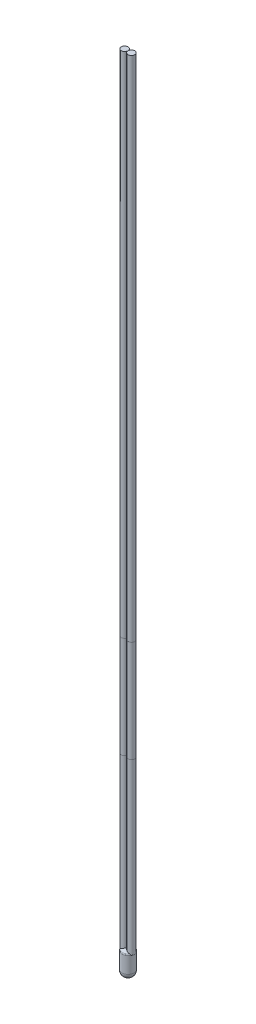
ISO-10303-21;
HEADER;
FILE_DESCRIPTION(('STEP AP214'),'2;1');
FILE_NAME('part.step','',(''),(''),'','','');
FILE_SCHEMA(('AUTOMOTIVE_DESIGN { 1 0 10303 214 1 1 1 1 }'));
ENDSEC;
DATA;
#1=APPLICATION_CONTEXT('core data for automotive mechanical design processes');
#2=APPLICATION_PROTOCOL_DEFINITION('international standard','automotive_design',2000,#1);
#3=PRODUCT_CONTEXT('',#1,'mechanical');
#4=PRODUCT('Part','Part','',(#3));
#5=PRODUCT_RELATED_PRODUCT_CATEGORY('part','',(#4));
#6=PRODUCT_DEFINITION_FORMATION('','',#4);
#7=PRODUCT_DEFINITION_CONTEXT('part definition',#1,'design');
#8=PRODUCT_DEFINITION('design','',#6,#7);
#9=PRODUCT_DEFINITION_SHAPE('','',#8);
#10=(LENGTH_UNIT() NAMED_UNIT(*) SI_UNIT(.MILLI.,.METRE.));
#11=(NAMED_UNIT(*) PLANE_ANGLE_UNIT() SI_UNIT($,.RADIAN.));
#12=(NAMED_UNIT(*) SI_UNIT($,.STERADIAN.) SOLID_ANGLE_UNIT());
#13=UNCERTAINTY_MEASURE_WITH_UNIT(LENGTH_MEASURE(1.E-05),#10,'distance_accuracy_value','');
#14=(GEOMETRIC_REPRESENTATION_CONTEXT(3) GLOBAL_UNCERTAINTY_ASSIGNED_CONTEXT((#13)) GLOBAL_UNIT_ASSIGNED_CONTEXT((#10,
#11,#12)) REPRESENTATION_CONTEXT('',''));
#15=CARTESIAN_POINT('',(0.,0.,0.));
#16=DIRECTION('',(0.,0.,1.));
#17=DIRECTION('',(1.,0.,0.));
#18=AXIS2_PLACEMENT_3D('',#15,#16,#17);
#19=CARTESIAN_POINT('',(0.4,117.41515621348,0.));
#20=DIRECTION('',(0.,-1.,0.));
#21=DIRECTION('',(0.,0.,-1.));
#22=AXIS2_PLACEMENT_3D('',#19,#20,#21);
#23=CYLINDRICAL_SURFACE('',#22,0.5);
#24=CARTESIAN_POINT('',(0.4,117.41515621348,0.));
#25=DIRECTION('',(0.,-1.,0.));
#26=DIRECTION('',(0.,0.,-1.));
#27=AXIS2_PLACEMENT_3D('',#24,#25,#26);
#28=CIRCLE('',#27,0.5);
#29=CARTESIAN_POINT('',(0.4,117.41515621348,-0.5));
#30=VERTEX_POINT('',#29);
#31=EDGE_CURVE('E11',#30,#30,#28,.T.);
#32=ORIENTED_EDGE('',*,*,#31,.T.);
#33=EDGE_LOOP('',(#32));
#34=FACE_BOUND('',#33,.T.);
#35=CARTESIAN_POINT('',(0.4,42.4151562134801,0.));
#36=DIRECTION('',(0.,-1.,0.));
#37=DIRECTION('',(0.,0.,-1.));
#38=AXIS2_PLACEMENT_3D('',#35,#36,#37);
#39=CIRCLE('',#38,0.5);
#40=CARTESIAN_POINT('',(0.4,42.4151562134801,-0.5));
#41=VERTEX_POINT('',#40);
#42=EDGE_CURVE('E46',#41,#41,#39,.T.);
#43=ORIENTED_EDGE('',*,*,#42,.F.);
#44=EDGE_LOOP('',(#43));
#45=FACE_BOUND('',#44,.T.);
#46=ADVANCED_FACE('F43',(#34,#45),#23,.T.);
#47=CARTESIAN_POINT('',(0.4,117.41515621348,0.));
#48=DIRECTION('',(0.,-1.,0.));
#49=DIRECTION('',(0.,0.,-1.));
#50=AXIS2_PLACEMENT_3D('',#47,#48,#49);
#51=PLANE('',#50);
#52=ORIENTED_EDGE('',*,*,#31,.F.);
#53=EDGE_LOOP('',(#52));
#54=FACE_BOUND('',#53,.T.);
#55=ADVANCED_FACE('F58',(#54),#51,.F.);
#56=CARTESIAN_POINT('',(0.4,42.4151562134801,0.));
#57=DIRECTION('',(0.,-1.,0.));
#58=DIRECTION('',(0.,0.,-1.));
#59=AXIS2_PLACEMENT_3D('',#56,#57,#58);
#60=PLANE('',#59);
#61=ORIENTED_EDGE('',*,*,#42,.T.);
#62=EDGE_LOOP('',(#61));
#63=FACE_BOUND('',#62,.T.);
#64=ADVANCED_FACE('F55',(#63),#60,.T.);
#65=CLOSED_SHELL('',(#46,#55,#64));
#66=MANIFOLD_SOLID_BREP('B2',#65);
#67=CARTESIAN_POINT('',(1.41,117.41515621348,0.));
#68=DIRECTION('',(0.,-1.,0.));
#69=DIRECTION('',(0.,0.,-1.));
#70=AXIS2_PLACEMENT_3D('',#67,#68,#69);
#71=CYLINDRICAL_SURFACE('',#70,0.5);
#72=CARTESIAN_POINT('',(1.41,117.41515621348,0.));
#73=DIRECTION('',(0.,-1.,0.));
#74=DIRECTION('',(0.,0.,-1.));
#75=AXIS2_PLACEMENT_3D('',#72,#73,#74);
#76=CIRCLE('',#75,0.5);
#77=CARTESIAN_POINT('',(1.41,117.41515621348,-0.5));
#78=VERTEX_POINT('',#77);
#79=EDGE_CURVE('E42',#78,#78,#76,.T.);
#80=ORIENTED_EDGE('',*,*,#79,.T.);
#81=EDGE_LOOP('',(#80));
#82=FACE_BOUND('',#81,.T.);
#83=CARTESIAN_POINT('',(1.41,42.4151562134801,0.));
#84=DIRECTION('',(0.,-1.,0.));
#85=DIRECTION('',(0.,0.,-1.));
#86=AXIS2_PLACEMENT_3D('',#83,#84,#85);
#87=CIRCLE('',#86,0.5);
#88=CARTESIAN_POINT('',(1.41,42.4151562134801,-0.5));
#89=VERTEX_POINT('',#88);
#90=EDGE_CURVE('E96',#89,#89,#87,.T.);
#91=ORIENTED_EDGE('',*,*,#90,.F.);
#92=EDGE_LOOP('',(#91));
#93=FACE_BOUND('',#92,.T.);
#94=ADVANCED_FACE('F93',(#82,#93),#71,.T.);
#95=CARTESIAN_POINT('',(1.41,117.41515621348,0.));
#96=DIRECTION('',(0.,-1.,0.));
#97=DIRECTION('',(0.,0.,-1.));
#98=AXIS2_PLACEMENT_3D('',#95,#96,#97);
#99=PLANE('',#98);
#100=ORIENTED_EDGE('',*,*,#79,.F.);
#101=EDGE_LOOP('',(#100));
#102=FACE_BOUND('',#101,.T.);
#103=ADVANCED_FACE('F108',(#102),#99,.F.);
#104=CARTESIAN_POINT('',(1.41,42.4151562134801,0.));
#105=DIRECTION('',(0.,-1.,0.));
#106=DIRECTION('',(0.,0.,-1.));
#107=AXIS2_PLACEMENT_3D('',#104,#105,#106);
#108=PLANE('',#107);
#109=ORIENTED_EDGE('',*,*,#90,.T.);
#110=EDGE_LOOP('',(#109));
#111=FACE_BOUND('',#110,.T.);
#112=ADVANCED_FACE('F105',(#111),#108,.T.);
#113=CLOSED_SHELL('',(#94,#103,#112));
#114=MANIFOLD_SOLID_BREP('B6',#113);
#115=CARTESIAN_POINT('',(0.4,42.41515621348,0.));
#116=DIRECTION('',(0.,-1.,0.));
#117=DIRECTION('',(0.,0.,-1.));
#118=AXIS2_PLACEMENT_3D('',#115,#116,#117);
#119=CYLINDRICAL_SURFACE('',#118,0.5);
#120=CARTESIAN_POINT('',(0.4,42.41515621348,0.));
#121=DIRECTION('',(0.,-1.,0.));
#122=DIRECTION('',(0.,0.,-1.));
#123=AXIS2_PLACEMENT_3D('',#120,#121,#122);
#124=CIRCLE('',#123,0.5);
#125=CARTESIAN_POINT('',(0.4,42.41515621348,-0.5));
#126=VERTEX_POINT('',#125);
#127=EDGE_CURVE('E92',#126,#126,#124,.T.);
#128=ORIENTED_EDGE('',*,*,#127,.T.);
#129=EDGE_LOOP('',(#128));
#130=FACE_BOUND('',#129,.T.);
#131=CARTESIAN_POINT('',(0.4,27.4151562134801,0.));
#132=DIRECTION('',(0.,-1.,0.));
#133=DIRECTION('',(0.,0.,-1.));
#134=AXIS2_PLACEMENT_3D('',#131,#132,#133);
#135=CIRCLE('',#134,0.5);
#136=CARTESIAN_POINT('',(0.4,27.4151562134801,-0.5));
#137=VERTEX_POINT('',#136);
#138=EDGE_CURVE('E146',#137,#137,#135,.T.);
#139=ORIENTED_EDGE('',*,*,#138,.F.);
#140=EDGE_LOOP('',(#139));
#141=FACE_BOUND('',#140,.T.);
#142=ADVANCED_FACE('F143',(#130,#141),#119,.T.);
#143=CARTESIAN_POINT('',(0.4,42.41515621348,0.));
#144=DIRECTION('',(0.,-1.,0.));
#145=DIRECTION('',(0.,0.,-1.));
#146=AXIS2_PLACEMENT_3D('',#143,#144,#145);
#147=PLANE('',#146);
#148=ORIENTED_EDGE('',*,*,#127,.F.);
#149=EDGE_LOOP('',(#148));
#150=FACE_BOUND('',#149,.T.);
#151=ADVANCED_FACE('F158',(#150),#147,.F.);
#152=CARTESIAN_POINT('',(0.4,27.4151562134801,0.));
#153=DIRECTION('',(0.,-1.,0.));
#154=DIRECTION('',(0.,0.,-1.));
#155=AXIS2_PLACEMENT_3D('',#152,#153,#154);
#156=PLANE('',#155);
#157=ORIENTED_EDGE('',*,*,#138,.T.);
#158=EDGE_LOOP('',(#157));
#159=FACE_BOUND('',#158,.T.);
#160=ADVANCED_FACE('F155',(#159),#156,.T.);
#161=CLOSED_SHELL('',(#142,#151,#160));
#162=MANIFOLD_SOLID_BREP('B37',#161);
#163=CARTESIAN_POINT('',(1.41,42.41515621348,0.));
#164=DIRECTION('',(0.,-1.,0.));
#165=DIRECTION('',(0.,0.,-1.));
#166=AXIS2_PLACEMENT_3D('',#163,#164,#165);
#167=CYLINDRICAL_SURFACE('',#166,0.5);
#168=CARTESIAN_POINT('',(1.41,42.41515621348,0.));
#169=DIRECTION('',(0.,-1.,0.));
#170=DIRECTION('',(0.,0.,-1.));
#171=AXIS2_PLACEMENT_3D('',#168,#169,#170);
#172=CIRCLE('',#171,0.5);
#173=CARTESIAN_POINT('',(1.41,42.41515621348,-0.5));
#174=VERTEX_POINT('',#173);
#175=EDGE_CURVE('E142',#174,#174,#172,.T.);
#176=ORIENTED_EDGE('',*,*,#175,.T.);
#177=EDGE_LOOP('',(#176));
#178=FACE_BOUND('',#177,.T.);
#179=CARTESIAN_POINT('',(1.41,27.4151562134801,0.));
#180=DIRECTION('',(0.,-1.,0.));
#181=DIRECTION('',(0.,0.,-1.));
#182=AXIS2_PLACEMENT_3D('',#179,#180,#181);
#183=CIRCLE('',#182,0.5);
#184=CARTESIAN_POINT('',(1.41,27.4151562134801,-0.5));
#185=VERTEX_POINT('',#184);
#186=EDGE_CURVE('E197',#185,#185,#183,.T.);
#187=ORIENTED_EDGE('',*,*,#186,.F.);
#188=EDGE_LOOP('',(#187));
#189=FACE_BOUND('',#188,.T.);
#190=ADVANCED_FACE('F194',(#178,#189),#167,.T.);
#191=CARTESIAN_POINT('',(1.41,42.41515621348,0.));
#192=DIRECTION('',(0.,-1.,0.));
#193=DIRECTION('',(0.,0.,-1.));
#194=AXIS2_PLACEMENT_3D('',#191,#192,#193);
#195=PLANE('',#194);
#196=ORIENTED_EDGE('',*,*,#175,.F.);
#197=EDGE_LOOP('',(#196));
#198=FACE_BOUND('',#197,.T.);
#199=ADVANCED_FACE('F209',(#198),#195,.F.);
#200=CARTESIAN_POINT('',(1.41,27.4151562134801,0.));
#201=DIRECTION('',(0.,-1.,0.));
#202=DIRECTION('',(0.,0.,-1.));
#203=AXIS2_PLACEMENT_3D('',#200,#201,#202);
#204=PLANE('',#203);
#205=ORIENTED_EDGE('',*,*,#186,.T.);
#206=EDGE_LOOP('',(#205));
#207=FACE_BOUND('',#206,.T.);
#208=ADVANCED_FACE('F206',(#207),#204,.T.);
#209=CLOSED_SHELL('',(#190,#199,#208));
#210=MANIFOLD_SOLID_BREP('B87',#209);
#211=CARTESIAN_POINT('',(0.9,2.41515621348005,0.));
#212=DIRECTION('',(0.,-1.,0.));
#213=DIRECTION('',(0.,0.,-1.));
#214=AXIS2_PLACEMENT_3D('',#211,#212,#213);
#215=TOROIDAL_SURFACE('',#214,0.7,0.2);
#216=CARTESIAN_POINT('',(0.342710554276178,2.6096711374537,-0.496707076060587));
#217=CARTESIAN_POINT('',(0.326116842533661,2.60699686254503,-0.494806533452094));
#218=CARTESIAN_POINT('',(0.309770034542115,2.6034465481936,-0.492066096214566));
#219=CARTESIAN_POINT('',(0.277889544530881,2.59470746117517,-0.48512967125796));
#220=CARTESIAN_POINT('',(0.262353719484357,2.58952329123451,-0.480937769219657));
#221=CARTESIAN_POINT('',(0.240017999274765,2.58066687672155,-0.473777730533588));
#222=CARTESIAN_POINT('',(0.232822842991616,2.57758212381183,-0.471284008196725));
#223=CARTESIAN_POINT('',(0.219024349225774,2.57118780814072,-0.466153855243099));
#224=CARTESIAN_POINT('',(0.212408981894553,2.56789487751942,-0.463529092972427));
#225=CARTESIAN_POINT('',(0.191949179806998,2.55694717914873,-0.454911632549412));
#226=CARTESIAN_POINT('',(0.178598488792885,2.54865469906437,-0.448536577987828));
#227=CARTESIAN_POINT('',(0.153524784459558,2.53020932378214,-0.435257162414345));
#228=CARTESIAN_POINT('',(0.141799299389649,2.52005930947381,-0.428353630542701));
#229=CARTESIAN_POINT('',(0.126569418460339,2.50363697795189,-0.418649525357035));
#230=CARTESIAN_POINT('',(0.122113207881949,2.49833768250554,-0.415697637179596));
#231=CARTESIAN_POINT('',(0.113792469919316,2.48716320505702,-0.410012721510245));
#232=CARTESIAN_POINT('',(0.109928621893607,2.48128737432261,-0.407279946999101));
#233=CARTESIAN_POINT('',(0.102936878314275,2.46879544056318,-0.402209449874787));
#234=CARTESIAN_POINT('',(0.0998222709618778,2.46216866395595,-0.399879041914674));
#235=CARTESIAN_POINT('',(0.094741260965691,2.44827830657245,-0.396014595776549));
#236=CARTESIAN_POINT('',(0.0927685097705873,2.44101851011371,-0.394476159746476));
#237=CARTESIAN_POINT('',(0.0910191836531889,2.43051207891519,-0.393104583886525));
#238=CARTESIAN_POINT('',(0.0906334576828592,2.42742055037154,-0.392800747026939));
#239=CARTESIAN_POINT('',(0.0901213443102036,2.42120391854913,-0.392396925349576));
#240=CARTESIAN_POINT('',(0.0899946835782171,2.41807885415697,-0.392296725682827));
#241=CARTESIAN_POINT('',(0.0900011063698889,2.41442991486687,-0.392301775511847));
#242=CARTESIAN_POINT('',(0.0900057868956716,2.4139036851019,-0.392305472963729));
#243=CARTESIAN_POINT('',(0.090014235433944,2.413377623837,-0.392312153477811));
#244=B_SPLINE_CURVE_WITH_KNOTS('',3,(#216,#217,#218,#219,#220,#221,#222,#223,#224,#225,#226,
#227,#228,#229,#230,#231,#232,#233,#234,#235,#236,#237,#238,#239,#240,#241,#242,#243),
.UNSPECIFIED.,.F.,.F.,(4,2,2,2,2,2,2,2,2,2,2,2,2,4),(0.,0.0506923185590828,0.101243089641447,
0.125877301665452,0.149389824798402,0.20011250552543,0.25075717596154,0.27330306641228,
0.295874623529552,0.3188210426462,0.341638626278481,0.351015232615933,0.360381940946825,
0.361960632231357),.UNSPECIFIED.);
#245=CARTESIAN_POINT('',(0.20555555555555,2.56422741198005,-0.460642331993803));
#246=VERTEX_POINT('',#245);
#247=CARTESIAN_POINT('',(0.0899999999999998,2.41515621348005,-0.39230090491866));
#248=VERTEX_POINT('',#247);
#249=EDGE_CURVE('E192',#246,#248,#244,.T.);
#250=ORIENTED_EDGE('',*,*,#249,.F.);
#251=CARTESIAN_POINT('',(0.9,2.56422741198004,0.));
#252=DIRECTION('',(0.,-1.,0.));
#253=DIRECTION('',(0.,0.,-1.));
#254=AXIS2_PLACEMENT_3D('',#251,#252,#253);
#255=CIRCLE('',#254,0.833333333333334);
#256=CARTESIAN_POINT('',(1.59072984749455,2.56422741198004,-0.466193867639426));
#257=VERTEX_POINT('',#256);
#258=EDGE_CURVE('E309',#257,#246,#255,.F.);
#259=ORIENTED_EDGE('',*,*,#258,.F.);
#260=CARTESIAN_POINT('',(1.70365777107542,2.40610173241104,-0.404679025262014));
#261=CARTESIAN_POINT('',(1.70389604383328,2.40904204718788,-0.404505427623607));
#262=CARTESIAN_POINT('',(1.70401566567529,2.41199833082941,-0.404418765222738));
#263=CARTESIAN_POINT('',(1.70402668102433,2.42065067536452,-0.404411663469807));
#264=CARTESIAN_POINT('',(1.70360453014876,2.42635106369644,-0.404719190328309));
#265=CARTESIAN_POINT('',(1.70193926885174,2.43757238417548,-0.40592158000119));
#266=CARTESIAN_POINT('',(1.70069414529646,2.44309284134493,-0.406817883031015));
#267=CARTESIAN_POINT('',(1.69705529388377,2.45534086403292,-0.409396462160241));
#268=CARTESIAN_POINT('',(1.69443632157332,2.46196830108167,-0.411229328202113));
#269=CARTESIAN_POINT('',(1.6883251125363,2.47463803783951,-0.415390033418));
#270=CARTESIAN_POINT('',(1.68483062700322,2.48067877425613,-0.41771914488632));
#271=CARTESIAN_POINT('',(1.67457897002656,2.49613661768594,-0.424329704327437));
#272=CARTESIAN_POINT('',(1.667222470359,2.50504524868047,-0.428858950109334));
#273=CARTESIAN_POINT('',(1.65127117178204,2.52156502452982,-0.438034406679147));
#274=CARTESIAN_POINT('',(1.64267468715311,2.52917437179056,-0.44268076947054));
#275=CARTESIAN_POINT('',(1.6201387405292,2.54676032002925,-0.453945963240291));
#276=CARTESIAN_POINT('',(1.60562904284585,2.55609680442867,-0.46042934676598));
#277=CARTESIAN_POINT('',(1.57632755446303,2.57208750828596,-0.471766359791853));
#278=CARTESIAN_POINT('',(1.56165246645707,2.57889713278662,-0.476709163323295));
#279=CARTESIAN_POINT('',(1.53128617958988,2.59087557342621,-0.485322279187297));
#280=CARTESIAN_POINT('',(1.51559544942571,2.59604514000795,-0.488993173579545));
#281=CARTESIAN_POINT('',(1.49493789755737,2.6015840638918,-0.492755412583465));
#282=CARTESIAN_POINT('',(1.49029630685466,2.60274909314161,-0.493533560329727));
#283=CARTESIAN_POINT('',(1.48562913972113,2.60384128817484,-0.494247137801567));
#284=B_SPLINE_CURVE_WITH_KNOTS('',3,(#260,#261,#262,#263,#264,#265,#266,#267,#268,#269,#270,
#271,#272,#273,#274,#275,#276,#277,#278,#279,#280,#281,#282,#283),.UNSPECIFIED.,.F.,.F.,(4,2,2,
2,2,2,2,2,2,2,2,4),(0.,0.00886575648618146,0.0259339496332779,0.0430440498313493,
0.0649928462677814,0.0869986080411961,0.124018945287599,0.161090093301615,0.216128364020064,
0.266736732211443,0.317321909974178,0.331862894329271),.UNSPECIFIED.);
#285=CARTESIAN_POINT('',(1.70401960784314,2.41515621348005,-0.404416209125905));
#286=VERTEX_POINT('',#285);
#287=EDGE_CURVE('E306',#286,#257,#284,.T.);
#288=ORIENTED_EDGE('',*,*,#287,.F.);
#289=CARTESIAN_POINT('',(0.9,2.41515621348005,0.));
#290=DIRECTION('',(0.,-1.,0.));
#291=DIRECTION('',(0.,0.,-1.));
#292=AXIS2_PLACEMENT_3D('',#289,#290,#291);
#293=CIRCLE('',#292,0.9);
#294=EDGE_CURVE('E286',#248,#286,#293,.T.);
#295=ORIENTED_EDGE('',*,*,#294,.F.);
#296=EDGE_LOOP('',(#250,#259,#288,#295));
#297=FACE_BOUND('',#296,.T.);
#298=ADVANCED_FACE('F236',(#297),#215,.T.);
#299=CARTESIAN_POINT('',(0.9,0.,0.));
#300=DIRECTION('',(0.,1.,0.));
#301=DIRECTION('',(-1.,0.,0.));
#302=AXIS2_PLACEMENT_3D('',#299,#300,#301);
#303=SPHERICAL_SURFACE('',#302,0.9);
#304=CARTESIAN_POINT('',(0.9,0.,0.));
#305=DIRECTION('',(0.,1.,0.));
#306=DIRECTION('',(-1.,0.,0.));
#307=AXIS2_PLACEMENT_3D('',#304,#305,#306);
#308=CIRCLE('',#307,0.9);
#309=CARTESIAN_POINT('',(0.,0.,0.));
#310=VERTEX_POINT('',#309);
#311=EDGE_CURVE('E341',#310,#310,#308,.T.);
#312=ORIENTED_EDGE('',*,*,#311,.F.);
#313=EDGE_LOOP('',(#312));
#314=FACE_BOUND('',#313,.T.);
#315=ADVANCED_FACE('F347',(#314),#303,.T.);
#316=CARTESIAN_POINT('',(0.9,1.63253242135513,0.));
#317=DIRECTION('',(0.,1.,0.));
#318=DIRECTION('',(1.,0.,0.));
#319=AXIS2_PLACEMENT_3D('',#316,#317,#318);
#320=SPHERICAL_SURFACE('',#319,1.25);
#321=CARTESIAN_POINT('',(0.205182917559304,2.56402741198004,0.460484857937039));
#322=CARTESIAN_POINT('',(0.233971584158858,2.57949526742104,0.472674656549754));
#323=CARTESIAN_POINT('',(0.263834888614331,2.59512545143631,0.482115388207938));
#324=CARTESIAN_POINT('',(0.324882062922831,2.62632224782333,0.495309528813332));
#325=CARTESIAN_POINT('',(0.356067821667557,2.64188873188452,0.499054500458566));
#326=CARTESIAN_POINT('',(0.418868509860483,2.6725351977644,0.500631357110796));
#327=CARTESIAN_POINT('',(0.450483793776784,2.68761473810425,0.498458020702542));
#328=CARTESIAN_POINT('',(0.513114021740049,2.71688826275654,0.488069098474938));
#329=CARTESIAN_POINT('',(0.544129378775547,2.73108287238938,0.479857832973678));
#330=CARTESIAN_POINT('',(0.603432306628539,2.75774534996512,0.457799964373355));
#331=CARTESIAN_POINT('',(0.63177740277301,2.77025632705399,0.444161179464198));
#332=CARTESIAN_POINT('',(0.685848125636114,2.79377590530834,0.411446097920221));
#333=CARTESIAN_POINT('',(0.711574532985435,2.80478495453323,0.392371428202314));
#334=CARTESIAN_POINT('',(0.757386234603006,2.82415850848364,0.350930619761693));
#335=CARTESIAN_POINT('',(0.777757354729829,2.83266364843309,0.328946524829438));
#336=CARTESIAN_POINT('',(0.814462558606548,2.84785970765273,0.281289176263675));
#337=CARTESIAN_POINT('',(0.830799225234937,2.85455178792111,0.255618299665267));
#338=CARTESIAN_POINT('',(0.857489245941004,2.8654218425138,0.203674733719494));
#339=CARTESIAN_POINT('',(0.868231347853134,2.8697643923131,0.177635896499791));
#340=CARTESIAN_POINT('',(0.885222369941649,2.87661208723217,0.123903501967717));
#341=CARTESIAN_POINT('',(0.891473128337311,2.8791179840666,0.0962106266531178));
#342=CARTESIAN_POINT('',(0.898965910680979,2.88211954734321,0.041750685962971));
#343=CARTESIAN_POINT('',(0.900485702044778,2.88272670445036,0.0150276235124846));
#344=CARTESIAN_POINT('',(0.899243453810239,2.88222979873035,-0.0383002481093894));
#345=CARTESIAN_POINT('',(0.896482151276341,2.88112603046862,-0.0649050768459279));
#346=CARTESIAN_POINT('',(0.886891665044591,2.87727947030919,-0.116688452941977));
#347=CARTESIAN_POINT('',(0.880145165673852,2.87456998989427,-0.141884903175672));
#348=CARTESIAN_POINT('',(0.862915071091583,2.86761424336565,-0.190737089252798));
#349=CARTESIAN_POINT('',(0.852431290747823,2.86336790112086,-0.214392748702007));
#350=CARTESIAN_POINT('',(0.827847365191678,2.85334074109884,-0.260064618192789));
#351=CARTESIAN_POINT('',(0.813674408302836,2.84752893513014,-0.28203472413694));
#352=CARTESIAN_POINT('',(0.782325180159593,2.83455869971222,-0.323262438719852));
#353=CARTESIAN_POINT('',(0.76514827462216,2.82739998583946,-0.342519472940525));
#354=CARTESIAN_POINT('',(0.727311137323574,2.81146328909359,-0.37893874801752));
#355=CARTESIAN_POINT('',(0.706510338279955,2.80261740798576,-0.395925003168429));
#356=CARTESIAN_POINT('',(0.662825996518049,2.78379890967995,-0.426179697109884));
#357=CARTESIAN_POINT('',(0.639941911935652,2.77382599917705,-0.439447164959857));
#358=CARTESIAN_POINT('',(0.590919832600233,2.7521510713304,-0.462972988952616));
#359=CARTESIAN_POINT('',(0.564666839933957,2.7403751389565,-0.47292344590208));
#360=CARTESIAN_POINT('',(0.511227452652452,2.7159880826072,-0.488264537929489));
#361=CARTESIAN_POINT('',(0.484040514212588,2.70337646791455,-0.493652467818506));
#362=CARTESIAN_POINT('',(0.427237457098062,2.67653045612116,-0.500139281132722));
#363=CARTESIAN_POINT('',(0.397601214368659,2.66224699485777,-0.500859985120792));
#364=CARTESIAN_POINT('',(0.338870422099756,2.63332105552434,-0.497120048615694));
#365=CARTESIAN_POINT('',(0.309775477916851,2.61867885861429,-0.492663346304868));
#366=CARTESIAN_POINT('',(0.255320650322216,2.59065781757185,-0.479358510250095));
#367=CARTESIAN_POINT('',(0.229856889277791,2.57728070845502,-0.470929440354684));
#368=CARTESIAN_POINT('',(0.205182917559304,2.56402741198004,-0.460484857937039));
#369=B_SPLINE_CURVE_WITH_KNOTS('',3,(#321,#322,#323,#324,#325,#326,#327,#328,#329,#330,#331,
#332,#333,#334,#335,#336,#337,#338,#339,#340,#341,#342,#343,#344,#345,#346,#347,#348,#349,#350,
#351,#352,#353,#354,#355,#356,#357,#358,#359,#360,#361,#362,#363,#364,#365,#366,#367,#368),
.UNSPECIFIED.,.F.,.F.,(4,2,2,2,2,2,2,2,2,2,2,2,2,2,2,2,2,2,2,2,2,2,2,4),(0.,0.104519174425416,
0.20919302598907,0.313959255757587,0.418650595024414,0.519668928761857,0.6206570602141,
0.713619584423865,0.806522438342577,0.891580597992968,0.976603925137676,1.05653092171055,
1.13644415899511,1.21475488229791,1.29306948538767,1.37306552614627,1.45307847848861,
1.53753986329398,1.62202327967901,1.71297064324907,1.80397189315789,1.90226336413096,
2.0004801188466,2.09008976680499),.UNSPECIFIED.);
#370=CARTESIAN_POINT('',(0.205555555555564,2.56422741198004,0.460642331993819));
#371=VERTEX_POINT('',#370);
#372=EDGE_CURVE('E351',#371,#246,#369,.T.);
#373=ORIENTED_EDGE('',*,*,#372,.F.);
#374=CARTESIAN_POINT('',(1.59072984749456,2.56422741198005,0.466193867639412));
#375=VERTEX_POINT('',#374);
#376=EDGE_CURVE('E301',#371,#375,#255,.F.);
#377=ORIENTED_EDGE('',*,*,#376,.T.);
#378=CARTESIAN_POINT('',(1.59109517886343,2.56402741198004,-0.466052074550069));
#379=CARTESIAN_POINT('',(1.56189929971724,2.58002767649732,-0.477407235839446));
#380=CARTESIAN_POINT('',(1.5316818590507,2.5961449455477,-0.485980166226311));
#381=CARTESIAN_POINT('',(1.47003320094678,2.62823131959863,-0.497371058581141));
#382=CARTESIAN_POINT('',(1.43859984411662,2.64420009583865,-0.500178358563004));
#383=CARTESIAN_POINT('',(1.37542839785553,2.67556238685268,-0.499803811214582));
#384=CARTESIAN_POINT('',(1.34369001114371,2.69095524923342,-0.496615369641568));
#385=CARTESIAN_POINT('',(1.28097777461012,2.72075295437588,-0.48412176576904));
#386=CARTESIAN_POINT('',(1.2500032981187,2.7351586254868,-0.474821802782654));
#387=CARTESIAN_POINT('',(1.19119294317666,2.76202627839447,-0.450656230430503));
#388=CARTESIAN_POINT('',(1.16327971356393,2.77454471742959,-0.43604282063928));
#389=CARTESIAN_POINT('',(1.11024446611085,2.79798858132722,-0.401432061815022));
#390=CARTESIAN_POINT('',(1.0851215269075,2.80891453240887,-0.381436497498158));
#391=CARTESIAN_POINT('',(1.0407752687385,2.82797897301611,-0.338444173481457));
#392=CARTESIAN_POINT('',(1.02123170291811,2.83627562384071,-0.31584813612629));
#393=CARTESIAN_POINT('',(0.986276705625963,2.85099541362998,-0.267124775723333));
#394=CARTESIAN_POINT('',(0.970862515398599,2.85741980366905,-0.240999827911772));
#395=CARTESIAN_POINT('',(0.946031278855372,2.86771350626024,-0.188425340736445));
#396=CARTESIAN_POINT('',(0.936210315890858,2.87175597935573,-0.162200075210661));
#397=CARTESIAN_POINT('',(0.921062025827062,2.87797472146548,-0.108272579146993));
#398=CARTESIAN_POINT('',(0.915732890355399,2.88015174150149,-0.0805709477619912));
#399=CARTESIAN_POINT('',(0.909985745536684,2.8824987342198,-0.026233701363912));
#400=CARTESIAN_POINT('',(0.909297636932613,2.8827790922807,0.000368946361625292));
#401=CARTESIAN_POINT('',(0.912143936315899,2.88161749969605,0.0533066389657466));
#402=CARTESIAN_POINT('',(0.915677693397838,2.88017581454623,0.0796417244644516));
#403=CARTESIAN_POINT('',(0.926726744789865,2.87565094977677,0.130850792933531));
#404=CARTESIAN_POINT('',(0.934175093104653,2.87259536624814,0.155741755923523));
#405=CARTESIAN_POINT('',(0.952722090923995,2.86494389413218,0.203867942016433));
#406=CARTESIAN_POINT('',(0.963820990405837,2.86034790006239,0.227103051599558));
#407=CARTESIAN_POINT('',(0.989597939229971,2.84959432158708,0.271933709776604));
#408=CARTESIAN_POINT('',(1.00436148335052,2.84339926927445,0.293470980003378));
#409=CARTESIAN_POINT('',(1.0367915879172,2.82966219620989,0.333743067860019));
#410=CARTESIAN_POINT('',(1.05445882941956,2.82211985941902,0.352477226051678));
#411=CARTESIAN_POINT('',(1.09327705208838,2.80536302982811,0.387835742875559));
#412=CARTESIAN_POINT('',(1.11457375722783,2.79607519027448,0.404265102837223));
#413=CARTESIAN_POINT('',(1.15913640261654,2.77637589549268,0.433331107082242));
#414=CARTESIAN_POINT('',(1.18240282445218,2.76596416530646,0.445966820383854));
#415=CARTESIAN_POINT('',(1.23219161707357,2.74334399642579,0.46817252389763));
#416=CARTESIAN_POINT('',(1.25882534023157,2.73105839843051,0.477414056831497));
#417=CARTESIAN_POINT('',(1.3129000686153,2.70566023022712,0.491275639916515));
#418=CARTESIAN_POINT('',(1.34034165891586,2.69254705239527,0.495892251401175));
#419=CARTESIAN_POINT('',(1.39761543819291,2.66463842718479,0.500739180828493));
#420=CARTESIAN_POINT('',(1.42745706499141,2.64979367367308,0.500573783170588));
#421=CARTESIAN_POINT('',(1.48643521179335,2.61978102430603,0.495008580568989));
#422=CARTESIAN_POINT('',(1.51557260551271,2.60461357795685,0.489615643314676));
#423=CARTESIAN_POINT('',(1.55994387438109,2.58096875538201,0.477275167916566));
#424=CARTESIAN_POINT('',(1.57566459684504,2.57247832366036,0.47205019083586));
#425=CARTESIAN_POINT('',(1.59109517886369,2.56402741198005,0.466052074550976));
#426=B_SPLINE_CURVE_WITH_KNOTS('',3,(#378,#379,#380,#381,#382,#383,#384,#385,#386,#387,#388,
#389,#390,#391,#392,#393,#394,#395,#396,#397,#398,#399,#400,#401,#402,#403,#404,#405,#406,#407,
#408,#409,#410,#411,#412,#413,#414,#415,#416,#417,#418,#419,#420,#421,#422,#423,#424,#425),
.UNSPECIFIED.,.F.,.F.,(4,2,2,2,2,2,2,2,2,2,2,2,2,2,2,2,2,2,2,2,2,2,2,4),(0.,0.105413590810882,
0.211021940887962,0.316746509188022,0.422381249651535,0.523545438942917,0.624676123545768,
0.717192495524503,0.809646904095704,0.894090213258967,0.97849950998854,1.057950460998,
1.13738916425129,1.21551153567365,1.29363925776357,1.37379673241425,1.45397303473647,
1.53897770241468,1.62400321368638,1.71586967701633,1.80780439322422,1.90736700377021,
2.00679899078983,2.06256833756391),.UNSPECIFIED.);
#427=EDGE_CURVE('E334',#257,#375,#426,.T.);
#428=ORIENTED_EDGE('',*,*,#427,.F.);
#429=ORIENTED_EDGE('',*,*,#258,.T.);
#430=EDGE_LOOP('',(#373,#377,#428,#429));
#431=FACE_BOUND('',#430,.T.);
#432=ADVANCED_FACE('F344',(#431),#320,.T.);
#433=CARTESIAN_POINT('',(0.9,2.88253242135513,0.));
#434=DIRECTION('',(0.,1.,0.));
#435=DIRECTION('',(-1.,0.,0.));
#436=AXIS2_PLACEMENT_3D('',#433,#434,#435);
#437=CYLINDRICAL_SURFACE('',#436,0.9);
#438=CARTESIAN_POINT('',(1.70401960784314,2.41515621348005,0.404416209125905));
#439=VERTEX_POINT('',#438);
#440=EDGE_CURVE('E305',#286,#439,#293,.T.);
#441=ORIENTED_EDGE('',*,*,#440,.T.);
#442=CARTESIAN_POINT('',(0.0899999999999999,2.41515621348005,0.392300904918661));
#443=VERTEX_POINT('',#442);
#444=EDGE_CURVE('E285',#439,#443,#293,.T.);
#445=ORIENTED_EDGE('',*,*,#444,.T.);
#446=EDGE_CURVE('E281',#443,#248,#293,.T.);
#447=ORIENTED_EDGE('',*,*,#446,.T.);
#448=ORIENTED_EDGE('',*,*,#294,.T.);
#449=EDGE_LOOP('',(#441,#445,#447,#448));
#450=FACE_BOUND('',#449,.T.);
#451=ORIENTED_EDGE('',*,*,#311,.T.);
#452=EDGE_LOOP('',(#451));
#453=FACE_BOUND('',#452,.T.);
#454=ADVANCED_FACE('F303',(#450,#453),#437,.T.);
#455=CARTESIAN_POINT('',(0.0900142354339442,2.413377623837,0.392312153477811));
#456=CARTESIAN_POINT('',(0.0900057541266962,2.41390364139671,0.392305440442877));
#457=CARTESIAN_POINT('',(0.0900010761450986,2.41442987026323,0.392301745679841));
#458=CARTESIAN_POINT('',(0.0899908939182519,2.42041031500487,0.392293808879575));
#459=CARTESIAN_POINT('',(0.0903876873945785,2.42587669504093,0.392608295677278));
#460=CARTESIAN_POINT('',(0.0919483170694864,2.43663689482024,0.393833813627084));
#461=CARTESIAN_POINT('',(0.0931148108885355,2.44193004974982,0.394746911592397));
#462=CARTESIAN_POINT('',(0.0965276680783706,2.45369226976503,0.397379300853799));
#463=CARTESIAN_POINT('',(0.0989878088160566,2.4600631115645,0.399254715860878));
#464=CARTESIAN_POINT('',(0.104721951369748,2.47223817724391,0.40351421133557));
#465=CARTESIAN_POINT('',(0.107997751237576,2.47804110931123,0.405899413919345));
#466=CARTESIAN_POINT('',(0.117726504458136,2.49309236848218,0.41276817561379));
#467=CARTESIAN_POINT('',(0.124772504708991,2.50182487308936,0.417529250579425));
#468=CARTESIAN_POINT('',(0.140059269926464,2.51803623911069,0.427216257759249));
#469=CARTESIAN_POINT('',(0.148302063542647,2.52551292445657,0.432142458744883));
#470=CARTESIAN_POINT('',(0.164542651928677,2.53851689638451,0.441173893519793));
#471=CARTESIAN_POINT('',(0.172427450644795,2.54417120238612,0.445301233098171));
#472=CARTESIAN_POINT('',(0.188767779307274,2.55479637884453,0.453281191485976));
#473=CARTESIAN_POINT('',(0.197223224947138,2.55976734992808,0.457133850704057));
#474=CARTESIAN_POINT('',(0.223478603776209,2.57382184269263,0.468189803567446));
#475=CARTESIAN_POINT('',(0.242044779602056,2.5819527279381,0.47482065562956));
#476=CARTESIAN_POINT('',(0.280663118502849,2.59574200515939,0.485965007769324));
#477=CARTESIAN_POINT('',(0.300713961297395,2.6014025637741,0.490480363533088));
#478=CARTESIAN_POINT('',(0.328336954348181,2.60718920951665,0.494891121079039));
#479=CARTESIAN_POINT('',(0.335501946546303,2.60851479514757,0.49587741575288));
#480=CARTESIAN_POINT('',(0.342710554276178,2.6096711374537,0.496707076060589));
#481=B_SPLINE_CURVE_WITH_KNOTS('',3,(#455,#456,#457,#458,#459,#460,#461,#462,#463,#464,#465,
#466,#467,#468,#469,#470,#471,#472,#473,#474,#475,#476,#477,#478,#479,#480),.UNSPECIFIED.,.F.,
.F.,(4,2,2,2,2,2,2,2,2,2,2,2,4),(0.,0.0015786912829187,0.0179374896072321,0.0343530692281405,
0.0554774301409264,0.0766487767120373,0.113012766125561,0.149439130714118,0.181025015527393,
0.212606244062943,0.276272276829786,0.339882357524839,0.361927766043739),.UNSPECIFIED.);
#482=EDGE_CURVE('E250',#443,#371,#481,.T.);
#483=ORIENTED_EDGE('',*,*,#482,.F.);
#484=ORIENTED_EDGE('',*,*,#444,.F.);
#485=CARTESIAN_POINT('',(1.59036397368029,2.56442741198001,0.466335541212821));
#486=CARTESIAN_POINT('',(1.5973360796673,2.56061873238883,0.463638603004759));
#487=CARTESIAN_POINT('',(1.60414324858272,2.5566067512118,0.460825637191355));
#488=CARTESIAN_POINT('',(1.61741257768417,2.54811962537918,0.455008912208966));
#489=CARTESIAN_POINT('',(1.62387350782681,2.54364297652896,0.452004546388216));
#490=CARTESIAN_POINT('',(1.6428145479229,2.52934307579804,0.442712237661609));
#491=CARTESIAN_POINT('',(1.65466155882263,2.51875065531443,0.436220958893895));
#492=CARTESIAN_POINT('',(1.66984634078226,2.50164628895631,0.427211907447637));
#493=CARTESIAN_POINT('',(1.67423847461032,2.4961638393826,0.424501579458626));
#494=CARTESIAN_POINT('',(1.68236683833714,2.4846313911739,0.419331780696356));
#495=CARTESIAN_POINT('',(1.68610460118604,2.47858277134815,0.416871729442884));
#496=CARTESIAN_POINT('',(1.69224707788071,2.46678204273043,0.412732811012051));
#497=CARTESIAN_POINT('',(1.69476616265774,2.46111220199629,0.41099248828768));
#498=CARTESIAN_POINT('',(1.69898751193248,2.4493557903195,0.408035423593887));
#499=CARTESIAN_POINT('',(1.70069279434929,2.44327085624681,0.406816748896858));
#500=CARTESIAN_POINT('',(1.70260094593574,2.43343733893364,0.405444763930635));
#501=CARTESIAN_POINT('',(1.70313408524625,2.42978365701233,0.405058934285818));
#502=CARTESIAN_POINT('',(1.70384867679137,2.42240680459159,0.404540494899205));
#503=CARTESIAN_POINT('',(1.70402841419422,2.41868338334019,0.404409119907637));
#504=CARTESIAN_POINT('',(1.70401943137251,2.41495621348005,0.404416337423927));
#505=B_SPLINE_CURVE_WITH_KNOTS('',3,(#485,#486,#487,#488,#489,#490,#491,#492,#493,#494,#495,
#496,#497,#498,#499,#500,#501,#502,#503,#504),.UNSPECIFIED.,.F.,.F.,(4,2,2,2,2,2,2,2,2,4),(0.,
0.0251482983136293,0.0503807063279775,0.101527724062385,0.124079925354553,0.146578566848934,
0.165844550411176,0.185038521513384,0.196151794836939,0.207318861922355),.UNSPECIFIED.);
#506=EDGE_CURVE('E302',#375,#439,#505,.T.);
#507=ORIENTED_EDGE('',*,*,#506,.F.);
#508=ORIENTED_EDGE('',*,*,#376,.F.);
#509=EDGE_LOOP('',(#483,#484,#507,#508));
#510=FACE_BOUND('',#509,.T.);
#511=ADVANCED_FACE('F238',(#510),#215,.T.);
#512=CARTESIAN_POINT('',(1.41,27.4151562134801,0.));
#513=DIRECTION('',(0.,-1.,0.));
#514=DIRECTION('',(0.,0.,-1.));
#515=AXIS2_PLACEMENT_3D('',#512,#513,#514);
#516=CYLINDRICAL_SURFACE('',#515,0.5);
#517=CARTESIAN_POINT('',(1.41,27.4151562134801,0.));
#518=DIRECTION('',(0.,-1.,0.));
#519=DIRECTION('',(0.,0.,-1.));
#520=AXIS2_PLACEMENT_3D('',#517,#518,#519);
#521=CIRCLE('',#520,0.5);
#522=CARTESIAN_POINT('',(1.41,27.4151562134801,-0.5));
#523=VERTEX_POINT('',#522);
#524=EDGE_CURVE('E342',#523,#523,#521,.T.);
#525=ORIENTED_EDGE('',*,*,#524,.T.);
#526=EDGE_LOOP('',(#525));
#527=FACE_BOUND('',#526,.T.);
#528=ORIENTED_EDGE('',*,*,#427,.T.);
#529=ORIENTED_EDGE('',*,*,#506,.T.);
#530=CARTESIAN_POINT('',(1.41,2.41515621348005,0.));
#531=DIRECTION('',(0.,-1.,0.));
#532=DIRECTION('',(0.,0.,-1.));
#533=AXIS2_PLACEMENT_3D('',#530,#531,#532);
#534=CIRCLE('',#533,0.5);
#535=EDGE_CURVE('E262',#286,#439,#534,.T.);
#536=ORIENTED_EDGE('',*,*,#535,.F.);
#537=ORIENTED_EDGE('',*,*,#287,.T.);
#538=EDGE_LOOP('',(#528,#529,#536,#537));
#539=FACE_BOUND('',#538,.T.);
#540=ADVANCED_FACE('F321',(#527,#539),#516,.T.);
#541=CARTESIAN_POINT('',(1.41,27.4151562134801,0.));
#542=DIRECTION('',(0.,-1.,0.));
#543=DIRECTION('',(0.,0.,-1.));
#544=AXIS2_PLACEMENT_3D('',#541,#542,#543);
#545=PLANE('',#544);
#546=ORIENTED_EDGE('',*,*,#524,.F.);
#547=EDGE_LOOP('',(#546));
#548=FACE_BOUND('',#547,.T.);
#549=ADVANCED_FACE('F326',(#548),#545,.F.);
#550=CARTESIAN_POINT('',(1.41,2.41515621348005,0.));
#551=DIRECTION('',(0.,-1.,0.));
#552=DIRECTION('',(0.,0.,-1.));
#553=AXIS2_PLACEMENT_3D('',#550,#551,#552);
#554=PLANE('',#553);
#555=ORIENTED_EDGE('',*,*,#535,.T.);
#556=ORIENTED_EDGE('',*,*,#440,.F.);
#557=EDGE_LOOP('',(#555,#556));
#558=FACE_BOUND('',#557,.T.);
#559=ADVANCED_FACE('F328',(#558),#554,.T.);
#560=CARTESIAN_POINT('',(0.4,27.4151562134801,0.));
#561=DIRECTION('',(0.,-1.,0.));
#562=DIRECTION('',(0.,0.,-1.));
#563=AXIS2_PLACEMENT_3D('',#560,#561,#562);
#564=CYLINDRICAL_SURFACE('',#563,0.5);
#565=CARTESIAN_POINT('',(0.4,27.4151562134801,0.));
#566=DIRECTION('',(0.,-1.,0.));
#567=DIRECTION('',(0.,0.,-1.));
#568=AXIS2_PLACEMENT_3D('',#565,#566,#567);
#569=CIRCLE('',#568,0.5);
#570=CARTESIAN_POINT('',(0.4,27.4151562134801,-0.5));
#571=VERTEX_POINT('',#570);
#572=EDGE_CURVE('E294',#571,#571,#569,.T.);
#573=ORIENTED_EDGE('',*,*,#572,.T.);
#574=EDGE_LOOP('',(#573));
#575=FACE_BOUND('',#574,.T.);
#576=ORIENTED_EDGE('',*,*,#372,.T.);
#577=ORIENTED_EDGE('',*,*,#249,.T.);
#578=CARTESIAN_POINT('',(0.4,2.41515621348005,0.));
#579=DIRECTION('',(0.,-1.,0.));
#580=DIRECTION('',(0.,0.,-1.));
#581=AXIS2_PLACEMENT_3D('',#578,#579,#580);
#582=CIRCLE('',#581,0.5);
#583=EDGE_CURVE('E256',#443,#248,#582,.T.);
#584=ORIENTED_EDGE('',*,*,#583,.F.);
#585=ORIENTED_EDGE('',*,*,#482,.T.);
#586=EDGE_LOOP('',(#576,#577,#584,#585));
#587=FACE_BOUND('',#586,.T.);
#588=ADVANCED_FACE('F290',(#575,#587),#564,.T.);
#589=CARTESIAN_POINT('',(0.4,27.4151562134801,0.));
#590=DIRECTION('',(0.,-1.,0.));
#591=DIRECTION('',(0.,0.,-1.));
#592=AXIS2_PLACEMENT_3D('',#589,#590,#591);
#593=PLANE('',#592);
#594=ORIENTED_EDGE('',*,*,#572,.F.);
#595=EDGE_LOOP('',(#594));
#596=FACE_BOUND('',#595,.T.);
#597=ADVANCED_FACE('F360',(#596),#593,.F.);
#598=CARTESIAN_POINT('',(0.4,2.41515621348005,0.));
#599=DIRECTION('',(0.,-1.,0.));
#600=DIRECTION('',(0.,0.,-1.));
#601=AXIS2_PLACEMENT_3D('',#598,#599,#600);
#602=PLANE('',#601);
#603=ORIENTED_EDGE('',*,*,#583,.T.);
#604=ORIENTED_EDGE('',*,*,#446,.F.);
#605=EDGE_LOOP('',(#603,#604));
#606=FACE_BOUND('',#605,.T.);
#607=ADVANCED_FACE('F282',(#606),#602,.T.);
#608=CLOSED_SHELL('',(#298,#315,#432,#454,#511,#540,#549,#559,#588,#597,#607));
#609=MANIFOLD_SOLID_BREP('B137',#608);
#610=ADVANCED_BREP_SHAPE_REPRESENTATION('',(#18,#66,#114,#162,#210,#609),#14);
#611=SHAPE_DEFINITION_REPRESENTATION(#9,#610);
ENDSEC;
END-ISO-10303-21;
